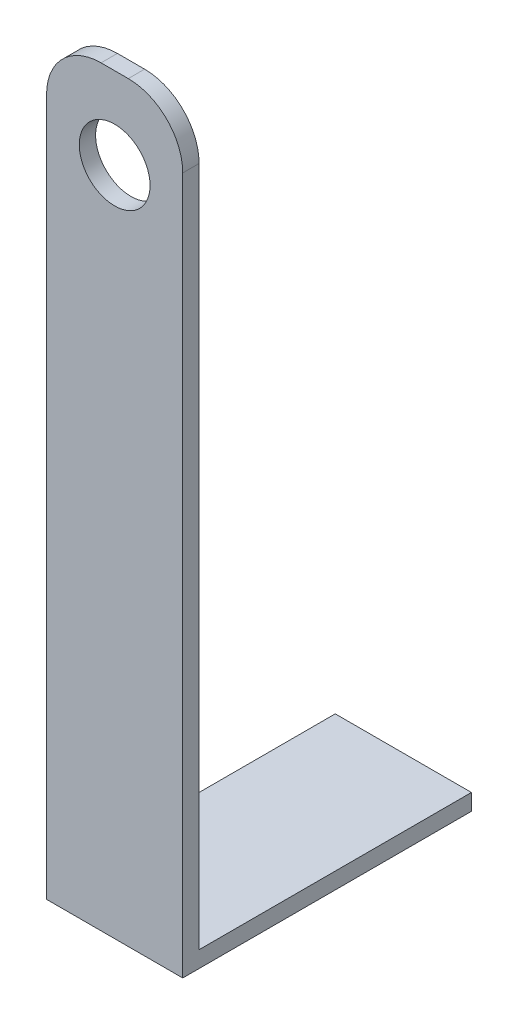
ISO-10303-21;
HEADER;
FILE_DESCRIPTION(('STEP AP214'),'2;1');
FILE_NAME('part.step','',(''),(''),'','','');
FILE_SCHEMA(('AUTOMOTIVE_DESIGN { 1 0 10303 214 1 1 1 1 }'));
ENDSEC;
DATA;
#1=APPLICATION_CONTEXT('core data for automotive mechanical design processes');
#2=APPLICATION_PROTOCOL_DEFINITION('international standard','automotive_design',2000,#1);
#3=PRODUCT_CONTEXT('',#1,'mechanical');
#4=PRODUCT('Part','Part','',(#3));
#5=PRODUCT_RELATED_PRODUCT_CATEGORY('part','',(#4));
#6=PRODUCT_DEFINITION_FORMATION('','',#4);
#7=PRODUCT_DEFINITION_CONTEXT('part definition',#1,'design');
#8=PRODUCT_DEFINITION('design','',#6,#7);
#9=PRODUCT_DEFINITION_SHAPE('','',#8);
#10=(LENGTH_UNIT() NAMED_UNIT(*) SI_UNIT(.MILLI.,.METRE.));
#11=(NAMED_UNIT(*) PLANE_ANGLE_UNIT() SI_UNIT($,.RADIAN.));
#12=(NAMED_UNIT(*) SI_UNIT($,.STERADIAN.) SOLID_ANGLE_UNIT());
#13=UNCERTAINTY_MEASURE_WITH_UNIT(LENGTH_MEASURE(1.E-05),#10,'distance_accuracy_value','');
#14=(GEOMETRIC_REPRESENTATION_CONTEXT(3) GLOBAL_UNCERTAINTY_ASSIGNED_CONTEXT((#13)) GLOBAL_UNIT_ASSIGNED_CONTEXT((#10,
#11,#12)) REPRESENTATION_CONTEXT('',''));
#15=CARTESIAN_POINT('',(0.,0.,0.));
#16=DIRECTION('',(0.,0.,1.));
#17=DIRECTION('',(1.,0.,0.));
#18=AXIS2_PLACEMENT_3D('',#15,#16,#17);
#19=CARTESIAN_POINT('',(25.,6.,50.));
#20=DIRECTION('',(-1.,0.,0.));
#21=DIRECTION('',(0.,0.,1.));
#22=AXIS2_PLACEMENT_3D('',#19,#20,#21);
#23=PLANE('',#22);
#24=DIRECTION('',(0.,-1.,0.));
#25=VECTOR('',#24,1.);
#26=CARTESIAN_POINT('',(25.,276.,50.));
#27=LINE('',#26,#25);
#28=CARTESIAN_POINT('',(25.,256.,50.));
#29=VERTEX_POINT('',#28);
#30=CARTESIAN_POINT('',(25.,6.,50.));
#31=VERTEX_POINT('',#30);
#32=EDGE_CURVE('E110',#29,#31,#27,.T.);
#33=ORIENTED_EDGE('',*,*,#32,.F.);
#34=DIRECTION('',(0.,0.,1.));
#35=VECTOR('',#34,1.);
#36=CARTESIAN_POINT('',(25.,256.,50.));
#37=LINE('',#36,#35);
#38=CARTESIAN_POINT('',(25.,256.,56.));
#39=VERTEX_POINT('',#38);
#40=EDGE_CURVE('E106',#29,#39,#37,.T.);
#41=ORIENTED_EDGE('',*,*,#40,.T.);
#42=DIRECTION('',(0.,-1.,0.));
#43=VECTOR('',#42,1.);
#44=CARTESIAN_POINT('',(25.,276.,56.));
#45=LINE('',#44,#43);
#46=CARTESIAN_POINT('',(25.,0.,56.));
#47=VERTEX_POINT('',#46);
#48=EDGE_CURVE('E100',#39,#47,#45,.T.);
#49=ORIENTED_EDGE('',*,*,#48,.T.);
#50=DIRECTION('',(0.,0.,-1.));
#51=VECTOR('',#50,1.);
#52=CARTESIAN_POINT('',(25.,0.,50.));
#53=LINE('',#52,#51);
#54=CARTESIAN_POINT('',(25.,0.,-50.));
#55=VERTEX_POINT('',#54);
#56=EDGE_CURVE('E104',#47,#55,#53,.T.);
#57=ORIENTED_EDGE('',*,*,#56,.T.);
#58=DIRECTION('',(0.,-1.,0.));
#59=VECTOR('',#58,1.);
#60=CARTESIAN_POINT('',(25.,6.,-50.));
#61=LINE('',#60,#59);
#62=CARTESIAN_POINT('',(25.,6.,-50.));
#63=VERTEX_POINT('',#62);
#64=EDGE_CURVE('E153',#63,#55,#61,.T.);
#65=ORIENTED_EDGE('',*,*,#64,.F.);
#66=DIRECTION('',(0.,0.,-1.));
#67=VECTOR('',#66,1.);
#68=CARTESIAN_POINT('',(25.,6.,50.));
#69=LINE('',#68,#67);
#70=EDGE_CURVE('E136',#31,#63,#69,.T.);
#71=ORIENTED_EDGE('',*,*,#70,.F.);
#72=EDGE_LOOP('',(#33,#41,#49,#57,#65,#71));
#73=FACE_BOUND('',#72,.T.);
#74=ADVANCED_FACE('F34',(#73),#23,.F.);
#75=CARTESIAN_POINT('',(-25.,6.,-50.));
#76=DIRECTION('',(0.,0.,1.));
#77=DIRECTION('',(1.,0.,0.));
#78=AXIS2_PLACEMENT_3D('',#75,#76,#77);
#79=PLANE('',#78);
#80=DIRECTION('',(-1.,0.,0.));
#81=VECTOR('',#80,1.);
#82=CARTESIAN_POINT('',(-25.,0.,-50.));
#83=LINE('',#82,#81);
#84=CARTESIAN_POINT('',(-25.,0.,-50.));
#85=VERTEX_POINT('',#84);
#86=EDGE_CURVE('E117',#55,#85,#83,.T.);
#87=ORIENTED_EDGE('',*,*,#86,.T.);
#88=DIRECTION('',(0.,-1.,0.));
#89=VECTOR('',#88,1.);
#90=CARTESIAN_POINT('',(-25.,6.,-50.));
#91=LINE('',#90,#89);
#92=CARTESIAN_POINT('',(-25.,6.,-50.));
#93=VERTEX_POINT('',#92);
#94=EDGE_CURVE('E147',#93,#85,#91,.T.);
#95=ORIENTED_EDGE('',*,*,#94,.F.);
#96=DIRECTION('',(-1.,0.,0.));
#97=VECTOR('',#96,1.);
#98=CARTESIAN_POINT('',(-25.,6.,-50.));
#99=LINE('',#98,#97);
#100=EDGE_CURVE('E139',#63,#93,#99,.T.);
#101=ORIENTED_EDGE('',*,*,#100,.F.);
#102=ORIENTED_EDGE('',*,*,#64,.T.);
#103=EDGE_LOOP('',(#87,#95,#101,#102));
#104=FACE_BOUND('',#103,.T.);
#105=ADVANCED_FACE('F182',(#104),#79,.F.);
#106=CARTESIAN_POINT('',(-25.,6.,50.));
#107=DIRECTION('',(1.,0.,0.));
#108=DIRECTION('',(0.,0.,-1.));
#109=AXIS2_PLACEMENT_3D('',#106,#107,#108);
#110=PLANE('',#109);
#111=DIRECTION('',(0.,-1.,0.));
#112=VECTOR('',#111,1.);
#113=CARTESIAN_POINT('',(-25.,276.,56.));
#114=LINE('',#113,#112);
#115=CARTESIAN_POINT('',(-25.,256.,56.));
#116=VERTEX_POINT('',#115);
#117=CARTESIAN_POINT('',(-25.,0.,56.));
#118=VERTEX_POINT('',#117);
#119=EDGE_CURVE('E109',#116,#118,#114,.T.);
#120=ORIENTED_EDGE('',*,*,#119,.F.);
#121=DIRECTION('',(0.,0.,1.));
#122=VECTOR('',#121,1.);
#123=CARTESIAN_POINT('',(-25.,256.,50.));
#124=LINE('',#123,#122);
#125=CARTESIAN_POINT('',(-25.,256.,50.));
#126=VERTEX_POINT('',#125);
#127=EDGE_CURVE('E11',#116,#126,#124,.F.);
#128=ORIENTED_EDGE('',*,*,#127,.T.);
#129=DIRECTION('',(0.,-1.,0.));
#130=VECTOR('',#129,1.);
#131=CARTESIAN_POINT('',(-25.,276.,50.));
#132=LINE('',#131,#130);
#133=CARTESIAN_POINT('',(-25.,6.00000000000001,50.));
#134=VERTEX_POINT('',#133);
#135=EDGE_CURVE('E134',#126,#134,#132,.T.);
#136=ORIENTED_EDGE('',*,*,#135,.T.);
#137=DIRECTION('',(0.,0.,1.));
#138=VECTOR('',#137,1.);
#139=CARTESIAN_POINT('',(-25.,6.,50.));
#140=LINE('',#139,#138);
#141=EDGE_CURVE('E142',#93,#134,#140,.T.);
#142=ORIENTED_EDGE('',*,*,#141,.F.);
#143=ORIENTED_EDGE('',*,*,#94,.T.);
#144=DIRECTION('',(0.,0.,1.));
#145=VECTOR('',#144,1.);
#146=CARTESIAN_POINT('',(-25.,0.,50.));
#147=LINE('',#146,#145);
#148=EDGE_CURVE('E140',#85,#118,#147,.T.);
#149=ORIENTED_EDGE('',*,*,#148,.T.);
#150=EDGE_LOOP('',(#120,#128,#136,#142,#143,#149));
#151=FACE_BOUND('',#150,.T.);
#152=ADVANCED_FACE('F178',(#151),#110,.F.);
#153=CARTESIAN_POINT('',(0.,6.,0.));
#154=DIRECTION('',(0.,-1.,0.));
#155=DIRECTION('',(0.,0.,-1.));
#156=AXIS2_PLACEMENT_3D('',#153,#154,#155);
#157=PLANE('',#156);
#158=ORIENTED_EDGE('',*,*,#70,.T.);
#159=ORIENTED_EDGE('',*,*,#100,.T.);
#160=ORIENTED_EDGE('',*,*,#141,.T.);
#161=DIRECTION('',(1.,0.,0.));
#162=VECTOR('',#161,1.);
#163=CARTESIAN_POINT('',(-25.,6.,50.));
#164=LINE('',#163,#162);
#165=EDGE_CURVE('E145',#134,#31,#164,.T.);
#166=ORIENTED_EDGE('',*,*,#165,.T.);
#167=EDGE_LOOP('',(#158,#159,#160,#166));
#168=FACE_BOUND('',#167,.T.);
#169=ADVANCED_FACE('F184',(#168),#157,.F.);
#170=CARTESIAN_POINT('',(0.,0.,0.));
#171=DIRECTION('',(0.,-1.,0.));
#172=DIRECTION('',(0.,0.,-1.));
#173=AXIS2_PLACEMENT_3D('',#170,#171,#172);
#174=PLANE('',#173);
#175=ORIENTED_EDGE('',*,*,#56,.F.);
#176=DIRECTION('',(-1.,0.,0.));
#177=VECTOR('',#176,1.);
#178=CARTESIAN_POINT('',(0.,0.,56.));
#179=LINE('',#178,#177);
#180=EDGE_CURVE('E116',#47,#118,#179,.T.);
#181=ORIENTED_EDGE('',*,*,#180,.T.);
#182=ORIENTED_EDGE('',*,*,#148,.F.);
#183=ORIENTED_EDGE('',*,*,#86,.F.);
#184=EDGE_LOOP('',(#175,#181,#182,#183));
#185=FACE_BOUND('',#184,.T.);
#186=ADVANCED_FACE('F114',(#185),#174,.T.);
#187=CARTESIAN_POINT('',(0.,276.,56.));
#188=DIRECTION('',(0.,0.,1.));
#189=DIRECTION('',(1.,0.,0.));
#190=AXIS2_PLACEMENT_3D('',#187,#188,#189);
#191=PLANE('',#190);
#192=CARTESIAN_POINT('',(0.,246.,56.));
#193=DIRECTION('',(0.,0.,1.));
#194=DIRECTION('',(1.,0.,0.));
#195=AXIS2_PLACEMENT_3D('',#192,#193,#194);
#196=CIRCLE('',#195,13.);
#197=CARTESIAN_POINT('',(13.,246.,56.));
#198=VERTEX_POINT('',#197);
#199=EDGE_CURVE('E128',#198,#198,#196,.T.);
#200=ORIENTED_EDGE('',*,*,#199,.F.);
#201=EDGE_LOOP('',(#200));
#202=FACE_BOUND('',#201,.T.);
#203=ORIENTED_EDGE('',*,*,#48,.F.);
#204=CARTESIAN_POINT('',(5.,256.,56.));
#205=DIRECTION('',(0.,0.,1.));
#206=DIRECTION('',(1.,0.,0.));
#207=AXIS2_PLACEMENT_3D('',#204,#205,#206);
#208=CIRCLE('',#207,20.);
#209=CARTESIAN_POINT('',(5.,276.,56.));
#210=VERTEX_POINT('',#209);
#211=EDGE_CURVE('E158',#39,#210,#208,.T.);
#212=ORIENTED_EDGE('',*,*,#211,.T.);
#213=DIRECTION('',(-1.,0.,0.));
#214=VECTOR('',#213,1.);
#215=CARTESIAN_POINT('',(0.,276.,56.));
#216=LINE('',#215,#214);
#217=CARTESIAN_POINT('',(-5.00000000000001,276.,56.));
#218=VERTEX_POINT('',#217);
#219=EDGE_CURVE('E125',#210,#218,#216,.T.);
#220=ORIENTED_EDGE('',*,*,#219,.T.);
#221=CARTESIAN_POINT('',(-5.00000000000001,256.,56.));
#222=DIRECTION('',(0.,0.,1.));
#223=DIRECTION('',(1.,0.,0.));
#224=AXIS2_PLACEMENT_3D('',#221,#222,#223);
#225=CIRCLE('',#224,20.);
#226=EDGE_CURVE('E156',#218,#116,#225,.T.);
#227=ORIENTED_EDGE('',*,*,#226,.T.);
#228=ORIENTED_EDGE('',*,*,#119,.T.);
#229=ORIENTED_EDGE('',*,*,#180,.F.);
#230=EDGE_LOOP('',(#203,#212,#220,#227,#228,#229));
#231=FACE_BOUND('',#230,.T.);
#232=ADVANCED_FACE('F120',(#202,#231),#191,.T.);
#233=CARTESIAN_POINT('',(0.,276.,50.));
#234=DIRECTION('',(0.,0.,1.));
#235=DIRECTION('',(1.,0.,0.));
#236=AXIS2_PLACEMENT_3D('',#233,#234,#235);
#237=PLANE('',#236);
#238=CARTESIAN_POINT('',(0.,246.,50.));
#239=DIRECTION('',(0.,0.,1.));
#240=DIRECTION('',(1.,0.,0.));
#241=AXIS2_PLACEMENT_3D('',#238,#239,#240);
#242=CIRCLE('',#241,13.);
#243=CARTESIAN_POINT('',(13.,246.,50.));
#244=VERTEX_POINT('',#243);
#245=EDGE_CURVE('E123',#244,#244,#242,.T.);
#246=ORIENTED_EDGE('',*,*,#245,.T.);
#247=EDGE_LOOP('',(#246));
#248=FACE_BOUND('',#247,.T.);
#249=DIRECTION('',(-1.,0.,0.));
#250=VECTOR('',#249,1.);
#251=CARTESIAN_POINT('',(0.,276.,50.));
#252=LINE('',#251,#250);
#253=CARTESIAN_POINT('',(5.,276.,50.));
#254=VERTEX_POINT('',#253);
#255=CARTESIAN_POINT('',(-5.00000000000001,276.,50.));
#256=VERTEX_POINT('',#255);
#257=EDGE_CURVE('E122',#254,#256,#252,.T.);
#258=ORIENTED_EDGE('',*,*,#257,.F.);
#259=CARTESIAN_POINT('',(5.,256.,50.));
#260=DIRECTION('',(0.,0.,1.));
#261=DIRECTION('',(1.,0.,0.));
#262=AXIS2_PLACEMENT_3D('',#259,#260,#261);
#263=CIRCLE('',#262,20.);
#264=EDGE_CURVE('E42',#254,#29,#263,.F.);
#265=ORIENTED_EDGE('',*,*,#264,.T.);
#266=ORIENTED_EDGE('',*,*,#32,.T.);
#267=ORIENTED_EDGE('',*,*,#165,.F.);
#268=ORIENTED_EDGE('',*,*,#135,.F.);
#269=CARTESIAN_POINT('',(-5.00000000000001,256.,50.));
#270=DIRECTION('',(0.,0.,1.));
#271=DIRECTION('',(1.,0.,0.));
#272=AXIS2_PLACEMENT_3D('',#269,#270,#271);
#273=CIRCLE('',#272,20.);
#274=EDGE_CURVE('E54',#126,#256,#273,.F.);
#275=ORIENTED_EDGE('',*,*,#274,.T.);
#276=EDGE_LOOP('',(#258,#265,#266,#267,#268,#275));
#277=FACE_BOUND('',#276,.T.);
#278=ADVANCED_FACE('F166',(#248,#277),#237,.F.);
#279=CARTESIAN_POINT('',(0.,276.,0.));
#280=DIRECTION('',(0.,-1.,0.));
#281=DIRECTION('',(0.,0.,-1.));
#282=AXIS2_PLACEMENT_3D('',#279,#280,#281);
#283=PLANE('',#282);
#284=ORIENTED_EDGE('',*,*,#219,.F.);
#285=DIRECTION('',(0.,0.,1.));
#286=VECTOR('',#285,1.);
#287=CARTESIAN_POINT('',(5.,276.,0.));
#288=LINE('',#287,#286);
#289=EDGE_CURVE('E163',#210,#254,#288,.F.);
#290=ORIENTED_EDGE('',*,*,#289,.T.);
#291=ORIENTED_EDGE('',*,*,#257,.T.);
#292=DIRECTION('',(0.,0.,1.));
#293=VECTOR('',#292,1.);
#294=CARTESIAN_POINT('',(-5.00000000000001,276.,0.));
#295=LINE('',#294,#293);
#296=EDGE_CURVE('E160',#256,#218,#295,.T.);
#297=ORIENTED_EDGE('',*,*,#296,.T.);
#298=EDGE_LOOP('',(#284,#290,#291,#297));
#299=FACE_BOUND('',#298,.T.);
#300=ADVANCED_FACE('F175',(#299),#283,.F.);
#301=CARTESIAN_POINT('',(0.,246.,-50.));
#302=DIRECTION('',(0.,0.,1.));
#303=DIRECTION('',(1.,0.,0.));
#304=AXIS2_PLACEMENT_3D('',#301,#302,#303);
#305=CYLINDRICAL_SURFACE('',#304,13.);
#306=ORIENTED_EDGE('',*,*,#199,.T.);
#307=EDGE_LOOP('',(#306));
#308=FACE_BOUND('',#307,.T.);
#309=ORIENTED_EDGE('',*,*,#245,.F.);
#310=EDGE_LOOP('',(#309));
#311=FACE_BOUND('',#310,.T.);
#312=ADVANCED_FACE('F201',(#308,#311),#305,.F.);
#313=CARTESIAN_POINT('',(5.,256.,50.));
#314=DIRECTION('',(0.,0.,1.));
#315=DIRECTION('',(1.,0.,0.));
#316=AXIS2_PLACEMENT_3D('',#313,#314,#315);
#317=CYLINDRICAL_SURFACE('',#316,20.);
#318=ORIENTED_EDGE('',*,*,#264,.F.);
#319=ORIENTED_EDGE('',*,*,#289,.F.);
#320=ORIENTED_EDGE('',*,*,#211,.F.);
#321=ORIENTED_EDGE('',*,*,#40,.F.);
#322=EDGE_LOOP('',(#318,#319,#320,#321));
#323=FACE_BOUND('',#322,.T.);
#324=ADVANCED_FACE('F171',(#323),#317,.T.);
#325=CARTESIAN_POINT('',(-5.00000000000001,256.,0.));
#326=DIRECTION('',(0.,0.,1.));
#327=DIRECTION('',(1.,0.,0.));
#328=AXIS2_PLACEMENT_3D('',#325,#326,#327);
#329=CYLINDRICAL_SURFACE('',#328,20.);
#330=ORIENTED_EDGE('',*,*,#274,.F.);
#331=ORIENTED_EDGE('',*,*,#127,.F.);
#332=ORIENTED_EDGE('',*,*,#226,.F.);
#333=ORIENTED_EDGE('',*,*,#296,.F.);
#334=EDGE_LOOP('',(#330,#331,#332,#333));
#335=FACE_BOUND('',#334,.T.);
#336=ADVANCED_FACE('F36',(#335),#329,.T.);
#337=CLOSED_SHELL('',(#74,#105,#152,#169,#186,#232,#278,#300,#312,#324,#336));
#338=MANIFOLD_SOLID_BREP('B2',#337);
#339=ADVANCED_BREP_SHAPE_REPRESENTATION('',(#18,#338),#14);
#340=SHAPE_DEFINITION_REPRESENTATION(#9,#339);
ENDSEC;
END-ISO-10303-21;
